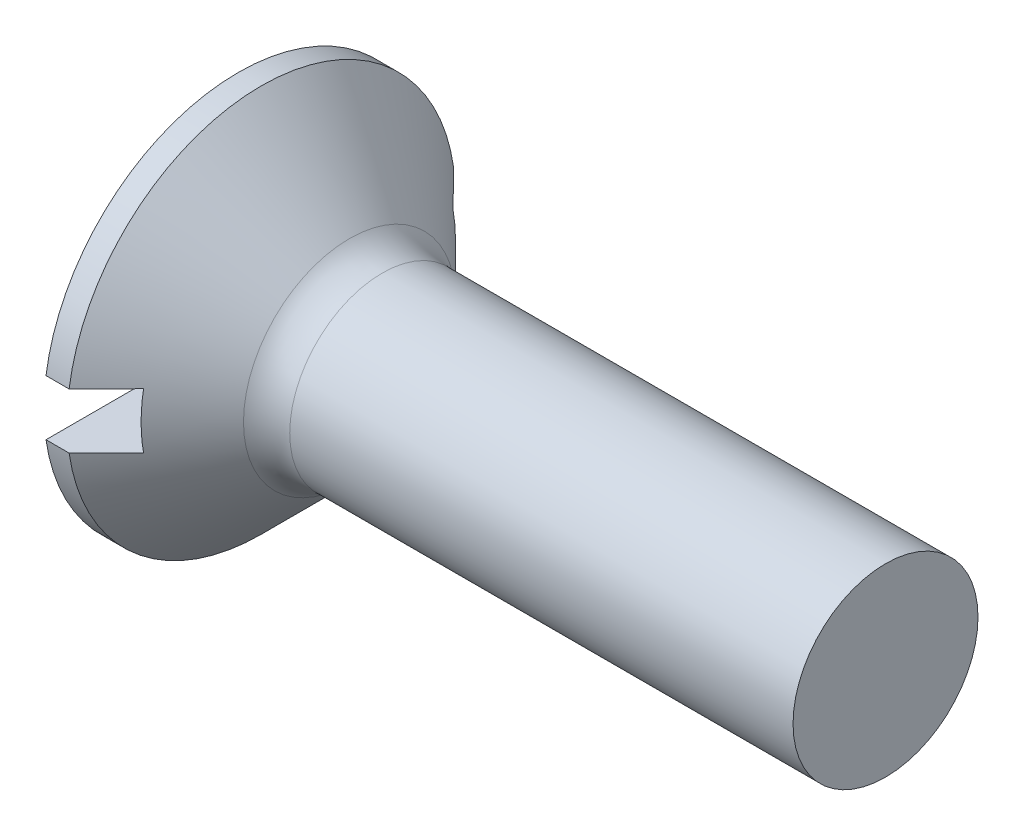
ISO-10303-21;
HEADER;
FILE_DESCRIPTION(('STEP AP214'),'2;1');
FILE_NAME('part.step','',(''),(''),'','','');
FILE_SCHEMA(('AUTOMOTIVE_DESIGN { 1 0 10303 214 1 1 1 1 }'));
ENDSEC;
DATA;
#1=APPLICATION_CONTEXT('core data for automotive mechanical design processes');
#2=APPLICATION_PROTOCOL_DEFINITION('international standard','automotive_design',2000,#1);
#3=PRODUCT_CONTEXT('',#1,'mechanical');
#4=PRODUCT('Part','Part','',(#3));
#5=PRODUCT_RELATED_PRODUCT_CATEGORY('part','',(#4));
#6=PRODUCT_DEFINITION_FORMATION('','',#4);
#7=PRODUCT_DEFINITION_CONTEXT('part definition',#1,'design');
#8=PRODUCT_DEFINITION('design','',#6,#7);
#9=PRODUCT_DEFINITION_SHAPE('','',#8);
#10=(LENGTH_UNIT() NAMED_UNIT(*) SI_UNIT(.MILLI.,.METRE.));
#11=(NAMED_UNIT(*) PLANE_ANGLE_UNIT() SI_UNIT($,.RADIAN.));
#12=(NAMED_UNIT(*) SI_UNIT($,.STERADIAN.) SOLID_ANGLE_UNIT());
#13=UNCERTAINTY_MEASURE_WITH_UNIT(LENGTH_MEASURE(1.E-05),#10,'distance_accuracy_value','');
#14=(GEOMETRIC_REPRESENTATION_CONTEXT(3) GLOBAL_UNCERTAINTY_ASSIGNED_CONTEXT((#13)) GLOBAL_UNIT_ASSIGNED_CONTEXT((#10,
#11,#12)) REPRESENTATION_CONTEXT('',''));
#15=CARTESIAN_POINT('',(0.,0.,0.));
#16=DIRECTION('',(0.,0.,1.));
#17=DIRECTION('',(1.,0.,0.));
#18=AXIS2_PLACEMENT_3D('',#15,#16,#17);
#19=CARTESIAN_POINT('',(0.,0.,0.));
#20=DIRECTION('',(-1.,0.,0.));
#21=DIRECTION('',(0.,0.,1.));
#22=AXIS2_PLACEMENT_3D('',#19,#20,#21);
#23=PLANE('',#22);
#24=DIRECTION('',(0.,0.,-1.));
#25=VECTOR('',#24,1.);
#26=CARTESIAN_POINT('',(0.,0.6,4.2));
#27=LINE('',#26,#25);
#28=CARTESIAN_POINT('',(0.,0.6,4.15692193816531));
#29=VERTEX_POINT('',#28);
#30=CARTESIAN_POINT('',(0.,0.599999999999999,-4.15692193816531));
#31=VERTEX_POINT('',#30);
#32=EDGE_CURVE('E169',#29,#31,#27,.T.);
#33=ORIENTED_EDGE('',*,*,#32,.F.);
#34=CARTESIAN_POINT('',(0.,0.,0.));
#35=DIRECTION('',(-1.,0.,0.));
#36=DIRECTION('',(0.,0.,1.));
#37=AXIS2_PLACEMENT_3D('',#34,#35,#36);
#38=CIRCLE('',#37,4.2);
#39=EDGE_CURVE('E113',#29,#31,#38,.T.);
#40=ORIENTED_EDGE('',*,*,#39,.T.);
#41=EDGE_LOOP('',(#33,#40));
#42=FACE_BOUND('',#41,.T.);
#43=ADVANCED_FACE('F32',(#42),#23,.T.);
#44=CARTESIAN_POINT('',(-6.34999999999999,0.,0.));
#45=DIRECTION('',(-1.,0.,0.));
#46=DIRECTION('',(0.,0.,1.));
#47=AXIS2_PLACEMENT_3D('',#44,#45,#46);
#48=CYLINDRICAL_SURFACE('',#47,4.2);
#49=DIRECTION('',(-1.,0.,0.));
#50=VECTOR('',#49,1.);
#51=CARTESIAN_POINT('',(-6.34999999999999,0.599999999999999,-4.15692193816531));
#52=LINE('',#51,#50);
#53=CARTESIAN_POINT('',(0.500000000000008,0.599999999999999,-4.15692193816531));
#54=VERTEX_POINT('',#53);
#55=EDGE_CURVE('E60',#31,#54,#52,.F.);
#56=ORIENTED_EDGE('',*,*,#55,.F.);
#57=ORIENTED_EDGE('',*,*,#39,.F.);
#58=DIRECTION('',(-1.,0.,0.));
#59=VECTOR('',#58,1.);
#60=CARTESIAN_POINT('',(-6.34999999999999,0.6,4.15692193816531));
#61=LINE('',#60,#59);
#62=CARTESIAN_POINT('',(0.500000000000007,0.6,4.15692193816531));
#63=VERTEX_POINT('',#62);
#64=EDGE_CURVE('E175',#63,#29,#61,.T.);
#65=ORIENTED_EDGE('',*,*,#64,.F.);
#66=CARTESIAN_POINT('',(0.500000000000008,0.,0.));
#67=DIRECTION('',(-1.,0.,0.));
#68=DIRECTION('',(0.,0.,1.));
#69=AXIS2_PLACEMENT_3D('',#66,#67,#68);
#70=CIRCLE('',#69,4.2);
#71=EDGE_CURVE('E107',#63,#54,#70,.T.);
#72=ORIENTED_EDGE('',*,*,#71,.T.);
#73=EDGE_LOOP('',(#56,#57,#65,#72));
#74=FACE_BOUND('',#73,.T.);
#75=ADVANCED_FACE('F153',(#74),#48,.T.);
#76=DIRECTION('',(0.,0.,1.));
#77=VECTOR('',#76,1.);
#78=CARTESIAN_POINT('',(0.,-0.600000000000001,-4.2));
#79=LINE('',#78,#77);
#80=CARTESIAN_POINT('',(0.,-0.600000000000001,-4.15692193816531));
#81=VERTEX_POINT('',#80);
#82=CARTESIAN_POINT('',(0.,-0.600000000000001,4.15692193816531));
#83=VERTEX_POINT('',#82);
#84=EDGE_CURVE('E101',#81,#83,#79,.T.);
#85=ORIENTED_EDGE('',*,*,#84,.F.);
#86=EDGE_CURVE('E109',#81,#83,#38,.T.);
#87=ORIENTED_EDGE('',*,*,#86,.T.);
#88=EDGE_LOOP('',(#85,#87));
#89=FACE_BOUND('',#88,.T.);
#90=ADVANCED_FACE('F155',(#89),#23,.T.);
#91=DIRECTION('',(-1.,0.,0.));
#92=VECTOR('',#91,1.);
#93=CARTESIAN_POINT('',(-6.34999999999999,-0.600000000000001,4.15692193816531));
#94=LINE('',#93,#92);
#95=CARTESIAN_POINT('',(0.500000000000008,-0.600000000000001,4.15692193816531));
#96=VERTEX_POINT('',#95);
#97=EDGE_CURVE('E174',#83,#96,#94,.F.);
#98=ORIENTED_EDGE('',*,*,#97,.F.);
#99=ORIENTED_EDGE('',*,*,#86,.F.);
#100=DIRECTION('',(-1.,0.,0.));
#101=VECTOR('',#100,1.);
#102=CARTESIAN_POINT('',(-6.34999999999999,-0.600000000000001,-4.15692193816531));
#103=LINE('',#102,#101);
#104=CARTESIAN_POINT('',(0.500000000000007,-0.600000000000001,-4.15692193816531));
#105=VERTEX_POINT('',#104);
#106=EDGE_CURVE('E172',#105,#81,#103,.T.);
#107=ORIENTED_EDGE('',*,*,#106,.F.);
#108=EDGE_CURVE('E110',#105,#96,#70,.T.);
#109=ORIENTED_EDGE('',*,*,#108,.T.);
#110=EDGE_LOOP('',(#98,#99,#107,#109));
#111=FACE_BOUND('',#110,.T.);
#112=ADVANCED_FACE('F150',(#111),#48,.T.);
#113=CARTESIAN_POINT('',(0.500000000000008,0.,0.));
#114=DIRECTION('',(-1.,0.,0.));
#115=DIRECTION('',(0.,0.,1.));
#116=AXIS2_PLACEMENT_3D('',#113,#114,#115);
#117=CONICAL_SURFACE('',#116,4.2,0.78539816339745);
#118=CARTESIAN_POINT('',(-4.56300554633495,0.599999999999999,-9.24355298310301));
#119=CARTESIAN_POINT('',(-4.24600723603534,0.599999999999999,-8.9258823515088));
#120=CARTESIAN_POINT('',(-3.92903833767224,0.599999999999999,-8.60818235148398));
#121=CARTESIAN_POINT('',(-3.29519089252672,0.599999999999999,-7.97268003561219));
#122=CARTESIAN_POINT('',(-2.97831234760131,0.599999999999999,-7.65487771791312));
#123=CARTESIAN_POINT('',(-2.34455187800565,0.599999999999999,-7.01900148987753));
#124=CARTESIAN_POINT('',(-2.02767001153056,0.599999999999999,-6.70092752152941));
#125=CARTESIAN_POINT('',(-1.39411705313906,0.599999999999999,-6.06458161569545));
#126=CARTESIAN_POINT('',(-1.07744595737823,0.599999999999999,-5.74630968203736));
#127=CARTESIAN_POINT('',(-0.439782710122314,0.599999999999999,-5.1047678174329));
#128=CARTESIAN_POINT('',(-0.118795367868508,0.599999999999999,-4.78149310334207));
#129=CARTESIAN_POINT('',(0.362237947121695,0.599999999999999,-4.2961185225288));
#130=CARTESIAN_POINT('',(0.522512438448331,0.599999999999999,-4.13424518132528));
#131=CARTESIAN_POINT('',(0.842841859731234,0.599999999999999,-3.81028322215853));
#132=CARTESIAN_POINT('',(1.00289679095939,0.6,-3.64819460545317));
#133=CARTESIAN_POINT('',(1.32264436811793,0.6,-3.32374686654893));
#134=CARTESIAN_POINT('',(1.48233710058699,0.6,-3.16138782970926));
#135=CARTESIAN_POINT('',(1.80122734793049,0.6,-2.83617699742847));
#136=CARTESIAN_POINT('',(1.96042485168805,0.6,-2.67332519108527));
#137=CARTESIAN_POINT('',(2.27798310090217,0.6,-2.346837401424));
#138=CARTESIAN_POINT('',(2.43634393039256,0.6,-2.1832015001327));
#139=CARTESIAN_POINT('',(2.67269924336134,0.6,-1.93661567733266));
#140=CARTESIAN_POINT('',(2.75128528365289,0.6,-1.8542332395846));
#141=CARTESIAN_POINT('',(2.90787263193201,0.6,-1.68891500745495));
#142=CARTESIAN_POINT('',(2.9858739476244,0.6,-1.60597922039208));
#143=CARTESIAN_POINT('',(3.10544684138226,0.6,-1.47745401397705));
#144=CARTESIAN_POINT('',(3.14733724784235,0.6,-1.43216144834644));
#145=CARTESIAN_POINT('',(3.23076972006657,0.6,-1.34125476648715));
#146=CARTESIAN_POINT('',(3.27231177917342,0.6,-1.29564064414372));
#147=CARTESIAN_POINT('',(3.35490511324606,0.6,-1.20402456521516));
#148=CARTESIAN_POINT('',(3.39595670135904,0.6,-1.15802289202377));
#149=CARTESIAN_POINT('',(3.47741398126422,0.6,-1.06545539858625));
#150=CARTESIAN_POINT('',(3.51781969732899,0.6,-1.01888959965672));
#151=CARTESIAN_POINT('',(3.61534617885595,0.6,-0.904304101505886));
#152=CARTESIAN_POINT('',(3.67198890051813,0.6,-0.835870311358796));
#153=CARTESIAN_POINT('',(3.75443491954113,0.6,-0.731128116472688));
#154=CARTESIAN_POINT('',(3.78151872315025,0.6,-0.695835241457916));
#155=CARTESIAN_POINT('',(3.83442818781308,0.6,-0.624333469704639));
#156=CARTESIAN_POINT('',(3.86025411081286,0.6,-0.58812476608869));
#157=CARTESIAN_POINT('',(3.91931375630114,0.6,-0.500871666719931));
#158=CARTESIAN_POINT('',(3.95177061612795,0.6,-0.449276850099302));
#159=CARTESIAN_POINT('',(3.99577967360525,0.6,-0.369336690861509));
#160=CARTESIAN_POINT('',(4.00966067743335,0.6,-0.342288140870185));
#161=CARTESIAN_POINT('',(4.03525638339725,0.6,-0.287195591030007));
#162=CARTESIAN_POINT('',(4.04697271406413,0.6,-0.259152358592044));
#163=CARTESIAN_POINT('',(4.06984222692527,0.6,-0.195380760375152));
#164=CARTESIAN_POINT('',(4.08024433174417,0.6,-0.159369843717824));
#165=CARTESIAN_POINT('',(4.09489065039257,0.6,-0.0861793611594762));
#166=CARTESIAN_POINT('',(4.09915715820778,0.6,-0.0490045302917276));
#167=CARTESIAN_POINT('',(4.10061628758592,0.6,0.0256851394983997));
#168=CARTESIAN_POINT('',(4.09777267133953,0.6,0.0632007452673676));
#169=CARTESIAN_POINT('',(4.08560858363434,0.6,0.137201967278454));
#170=CARTESIAN_POINT('',(4.07626994022889,0.6,0.173684394091389));
#171=CARTESIAN_POINT('',(4.05240105619193,0.6,0.246171642438104));
#172=CARTESIAN_POINT('',(4.03770931771714,0.6,0.282120755866795));
#173=CARTESIAN_POINT('',(4.0048507034635,0.6,0.352421052836944));
#174=CARTESIAN_POINT('',(3.98667753444948,0.6,0.386769200401987));
#175=CARTESIAN_POINT('',(3.94786976325244,0.6,0.454391698020889));
#176=CARTESIAN_POINT('',(3.92721638813711,0.6,0.487655075912775));
#177=CARTESIAN_POINT('',(3.88433578239058,0.6,0.553097784406296));
#178=CARTESIAN_POINT('',(3.86210991115064,0.6,0.585278016688102));
#179=CARTESIAN_POINT('',(3.81457382028797,0.6,0.651581987389193));
#180=CARTESIAN_POINT('',(3.7891630851111,0.6,0.685633148831194));
#181=CARTESIAN_POINT('',(3.73740972159131,0.6,0.753022281860292));
#182=CARTESIAN_POINT('',(3.71106696643727,0.6,0.786360155399126));
#183=CARTESIAN_POINT('',(3.63101189507472,0.6,0.885596261553081));
#184=CARTESIAN_POINT('',(3.57629754538183,0.6,0.950683598839951));
#185=CARTESIAN_POINT('',(3.46525380311496,0.6,1.07965626888597));
#186=CARTESIAN_POINT('',(3.40892163508868,0.6,1.14353918079179));
#187=CARTESIAN_POINT('',(3.29530585051175,0.6,1.27041803727517));
#188=CARTESIAN_POINT('',(3.23802251714466,0.6,1.33341423588146));
#189=CARTESIAN_POINT('',(3.12298479001919,0.6,1.45862383839196));
#190=CARTESIAN_POINT('',(3.06523233266877,0.6,1.52083902752064));
#191=CARTESIAN_POINT('',(2.94927074499088,0.6,1.64485037779584));
#192=CARTESIAN_POINT('',(2.89106158145176,0.6,1.70664650784765));
#193=CARTESIAN_POINT('',(2.71607782742413,0.6,1.8914362035954));
#194=CARTESIAN_POINT('',(2.598818175117,0.6,2.01396998991091));
#195=CARTESIAN_POINT('',(2.36411448960321,0.6,2.25774708248496));
#196=CARTESIAN_POINT('',(2.2466739355813,0.6,2.37899374959426));
#197=CARTESIAN_POINT('',(2.011320643903,0.6,2.62102822482681));
#198=CARTESIAN_POINT('',(1.89340790524034,0.6,2.74181603197111));
#199=CARTESIAN_POINT('',(1.53920067574072,0.6,3.10372997116225));
#200=CARTESIAN_POINT('',(1.30244210211621,0.6,3.34440153097691));
#201=CARTESIAN_POINT('',(0.828195724568521,0.6,3.82523070246839));
#202=CARTESIAN_POINT('',(0.590707648083579,0.6,4.06538804483313));
#203=CARTESIAN_POINT('',(0.115359689803594,0.6,4.54532999337504));
#204=CARTESIAN_POINT('',(-0.122500188487137,0.6,4.78511460302333));
#205=CARTESIAN_POINT('',(-0.598435859528591,0.6,5.26442998810649));
#206=CARTESIAN_POINT('',(-0.836511632808682,0.6,5.50396078288318));
#207=CARTESIAN_POINT('',(-1.31282357210655,0.6,5.9828640036053));
#208=CARTESIAN_POINT('',(-1.55105973851771,0.600000000000001,6.22223642915941));
#209=CARTESIAN_POINT('',(-2.26588146323333,0.600000000000001,6.94013600092059));
#210=CARTESIAN_POINT('',(-2.74263267398125,0.600000000000001,7.41849819223158));
#211=CARTESIAN_POINT('',(-3.33143893672129,0.600000000000001,8.0089998304997));
#212=CARTESIAN_POINT('',(-3.44338145682948,0.600000000000001,8.12125154439743));
#213=CARTESIAN_POINT('',(-3.66728071302648,0.600000000000001,8.34574469921585));
#214=CARTESIAN_POINT('',(-3.77923744932913,0.600000000000001,8.45798613992331));
#215=CARTESIAN_POINT('',(-4.0031582180191,0.600000000000001,8.68245495354625));
#216=CARTESIAN_POINT('',(-4.11512225008232,0.600000000000001,8.79468232678506));
#217=CARTESIAN_POINT('',(-4.33905795383685,0.600000000000001,9.019125541103));
#218=CARTESIAN_POINT('',(-4.45102962536065,0.600000000000001,9.13134138234926));
#219=CARTESIAN_POINT('',(-4.56300554633495,0.600000000000001,9.24355298310301));
#220=B_SPLINE_CURVE_WITH_KNOTS('',3,(#118,#119,#120,#121,#122,#123,#124,#125,#126,#127,#128,
#129,#130,#131,#132,#133,#134,#135,#136,#137,#138,#139,#140,#141,#142,#143,#144,#145,#146,#147,
#148,#149,#150,#151,#152,#153,#154,#155,#156,#157,#158,#159,#160,#161,#162,#163,#164,#165,#166,
#167,#168,#169,#170,#171,#172,#173,#174,#175,#176,#177,#178,#179,#180,#181,#182,#183,#184,#185,
#186,#187,#188,#189,#190,#191,#192,#193,#194,#195,#196,#197,#198,#199,#200,#201,#202,#203,#204,
#205,#206,#207,#208,#209,#210,#211,#212,#213,#214,#215,#216,#217,#218,#219),.UNSPECIFIED.,.F.,
.F.,(4,2,2,2,2,2,2,2,2,2,2,2,2,2,2,2,2,2,2,2,2,2,2,2,2,2,2,2,2,2,2,2,2,2,2,2,2,2,2,2,2,2,2,2,2,
2,2,2,2,2,4),(0.,1.34633691031337,2.6926997414925,4.03964677515628,5.38656852786769,
6.75326280996175,7.43664982710673,8.12003286861158,8.80323043061789,9.48644321990409,
10.1695860319826,10.5111450988142,10.8526996570424,11.03778202096,11.2228679139641,
11.4078285352327,11.5927821890647,11.8592146640371,11.9926530436262,12.1260635156147,
12.3086320349772,12.399769493737,12.490838106084,12.6028793993505,12.7145125475576,
12.8267158093192,12.939234265636,13.0554743148281,13.1719265035455,13.2893234418316,
13.4066201044699,13.5340600053015,13.6615173128626,13.91655652205,14.1720630220887,
14.4274947695286,14.6821578166047,14.9368395576516,15.4456347637855,15.9520298164414,
16.4584259488448,17.4712394731476,18.484493856319,19.4977387462517,20.5108998896107,
21.5240635270661,23.5501676869924,24.0257559307744,24.5013524664906,24.9769345830622,
25.4525083962336),.UNSPECIFIED.);
#221=CARTESIAN_POINT('',(1.3,0.6,3.34664010613631));
#222=VERTEX_POINT('',#221);
#223=EDGE_CURVE('E11',#222,#63,#220,.T.);
#224=ORIENTED_EDGE('',*,*,#223,.F.);
#225=CARTESIAN_POINT('',(1.3,0.,0.));
#226=DIRECTION('',(1.,0.,0.));
#227=DIRECTION('',(0.,0.,-1.));
#228=AXIS2_PLACEMENT_3D('',#225,#226,#227);
#229=CIRCLE('',#228,3.40000000000001);
#230=CARTESIAN_POINT('',(1.3,-0.600000000000001,3.34664010613631));
#231=VERTEX_POINT('',#230);
#232=EDGE_CURVE('E89',#231,#222,#229,.F.);
#233=ORIENTED_EDGE('',*,*,#232,.F.);
#234=CARTESIAN_POINT('',(-4.56300554633495,-0.600000000000001,9.24355298310301));
#235=CARTESIAN_POINT('',(-4.24600723603534,-0.600000000000001,8.9258823515088));
#236=CARTESIAN_POINT('',(-3.92903833767224,-0.600000000000001,8.60818235148397));
#237=CARTESIAN_POINT('',(-3.29519089252671,-0.600000000000001,7.97268003561219));
#238=CARTESIAN_POINT('',(-2.9783123476013,-0.600000000000001,7.65487771791311));
#239=CARTESIAN_POINT('',(-2.34455187800563,-0.600000000000001,7.01900148987752));
#240=CARTESIAN_POINT('',(-2.02767001153054,-0.600000000000001,6.7009275215294));
#241=CARTESIAN_POINT('',(-1.39411705313904,-0.600000000000001,6.06458161569543));
#242=CARTESIAN_POINT('',(-1.07744595737821,-0.600000000000001,5.74630968203734));
#243=CARTESIAN_POINT('',(-0.439782710122293,-0.600000000000001,5.10476781743288));
#244=CARTESIAN_POINT('',(-0.118795367868489,-0.600000000000001,4.78149310334206));
#245=CARTESIAN_POINT('',(0.362237947121712,-0.600000000000001,4.29611852252878));
#246=CARTESIAN_POINT('',(0.522512438448347,-0.600000000000001,4.13424518132526));
#247=CARTESIAN_POINT('',(0.842841859731247,-0.600000000000001,3.81028322215852));
#248=CARTESIAN_POINT('',(1.0028967909594,-0.600000000000001,3.64819460545316));
#249=CARTESIAN_POINT('',(1.32264436811794,-0.600000000000001,3.32374686654892));
#250=CARTESIAN_POINT('',(1.482337100587,-0.600000000000001,3.16138782970925));
#251=CARTESIAN_POINT('',(1.8012273479305,-0.600000000000001,2.83617699742846));
#252=CARTESIAN_POINT('',(1.96042485168806,-0.600000000000001,2.67332519108526));
#253=CARTESIAN_POINT('',(2.27798310090218,-0.600000000000001,2.346837401424));
#254=CARTESIAN_POINT('',(2.43634393039256,-0.600000000000001,2.18320150013269));
#255=CARTESIAN_POINT('',(2.67269924336134,-0.600000000000001,1.93661567733266));
#256=CARTESIAN_POINT('',(2.75128528365289,-0.600000000000001,1.85423323958459));
#257=CARTESIAN_POINT('',(2.90787263193201,-0.600000000000001,1.68891500745495));
#258=CARTESIAN_POINT('',(2.98587394762441,-0.600000000000001,1.60597922039208));
#259=CARTESIAN_POINT('',(3.10544684138226,-0.600000000000001,1.47745401397705));
#260=CARTESIAN_POINT('',(3.14733724784235,-0.600000000000001,1.43216144834644));
#261=CARTESIAN_POINT('',(3.23076972006657,-0.600000000000001,1.34125476648715));
#262=CARTESIAN_POINT('',(3.27231177917342,-0.600000000000001,1.29564064414372));
#263=CARTESIAN_POINT('',(3.35490511324606,-0.600000000000001,1.20402456521516));
#264=CARTESIAN_POINT('',(3.39595670135904,-0.600000000000001,1.15802289202377));
#265=CARTESIAN_POINT('',(3.47741398126422,-0.600000000000001,1.06545539858625));
#266=CARTESIAN_POINT('',(3.51781969732899,-0.600000000000001,1.01888959965672));
#267=CARTESIAN_POINT('',(3.61534617885595,-0.600000000000001,0.904304101505885));
#268=CARTESIAN_POINT('',(3.67198890051813,-0.600000000000001,0.835870311358794));
#269=CARTESIAN_POINT('',(3.75443491954113,-0.600000000000001,0.731128116472686));
#270=CARTESIAN_POINT('',(3.78151872315025,-0.600000000000001,0.695835241457914));
#271=CARTESIAN_POINT('',(3.83442818781308,-0.600000000000001,0.624333469704636));
#272=CARTESIAN_POINT('',(3.86025411081286,-0.600000000000001,0.588124766088687));
#273=CARTESIAN_POINT('',(3.91931375630114,-0.600000000000001,0.500871666719928));
#274=CARTESIAN_POINT('',(3.95177061612795,-0.600000000000001,0.449276850099299));
#275=CARTESIAN_POINT('',(3.99577967360525,-0.600000000000001,0.369336690861508));
#276=CARTESIAN_POINT('',(4.00966067743335,-0.600000000000001,0.342288140870185));
#277=CARTESIAN_POINT('',(4.03525638339725,-0.600000000000001,0.287195591030007));
#278=CARTESIAN_POINT('',(4.04697271406413,-0.600000000000001,0.259152358592045));
#279=CARTESIAN_POINT('',(4.06984222692527,-0.600000000000001,0.195380760375153));
#280=CARTESIAN_POINT('',(4.08024433174417,-0.600000000000001,0.159369843717825));
#281=CARTESIAN_POINT('',(4.09489065039257,-0.600000000000001,0.0861793611594771));
#282=CARTESIAN_POINT('',(4.09915715820778,-0.600000000000001,0.0490045302917284));
#283=CARTESIAN_POINT('',(4.10061628758592,-0.600000000000001,-0.0256851394983988));
#284=CARTESIAN_POINT('',(4.09777267133953,-0.600000000000001,-0.0632007452673665));
#285=CARTESIAN_POINT('',(4.08560858363434,-0.600000000000001,-0.137201967278453));
#286=CARTESIAN_POINT('',(4.07626994022889,-0.600000000000001,-0.173684394091389));
#287=CARTESIAN_POINT('',(4.05240105619192,-0.600000000000001,-0.246171642438104));
#288=CARTESIAN_POINT('',(4.03770931771714,-0.600000000000001,-0.282120755866795));
#289=CARTESIAN_POINT('',(4.0048507034635,-0.600000000000001,-0.352421052836943));
#290=CARTESIAN_POINT('',(3.98667753444948,-0.600000000000001,-0.386769200401986));
#291=CARTESIAN_POINT('',(3.94786976325244,-0.600000000000001,-0.454391698020888));
#292=CARTESIAN_POINT('',(3.92721638813711,-0.600000000000001,-0.487655075912773));
#293=CARTESIAN_POINT('',(3.88433578239059,-0.600000000000001,-0.553097784406295));
#294=CARTESIAN_POINT('',(3.86210991115064,-0.600000000000001,-0.585278016688101));
#295=CARTESIAN_POINT('',(3.81457382028797,-0.600000000000001,-0.651581987389193));
#296=CARTESIAN_POINT('',(3.7891630851111,-0.600000000000001,-0.685633148831194));
#297=CARTESIAN_POINT('',(3.73740972159131,-0.600000000000001,-0.753022281860292));
#298=CARTESIAN_POINT('',(3.71106696643727,-0.600000000000001,-0.786360155399125));
#299=CARTESIAN_POINT('',(3.63101189507472,-0.600000000000001,-0.88559626155308));
#300=CARTESIAN_POINT('',(3.57629754538184,-0.600000000000001,-0.950683598839949));
#301=CARTESIAN_POINT('',(3.46525380311496,-0.600000000000001,-1.07965626888597));
#302=CARTESIAN_POINT('',(3.40892163508868,-0.600000000000001,-1.14353918079178));
#303=CARTESIAN_POINT('',(3.29530585051175,-0.600000000000001,-1.27041803727517));
#304=CARTESIAN_POINT('',(3.23802251714466,-0.600000000000001,-1.33341423588145));
#305=CARTESIAN_POINT('',(3.12298479001919,-0.600000000000001,-1.45862383839196));
#306=CARTESIAN_POINT('',(3.06523233266877,-0.600000000000001,-1.52083902752064));
#307=CARTESIAN_POINT('',(2.94927074499088,-0.600000000000001,-1.64485037779583));
#308=CARTESIAN_POINT('',(2.89106158145176,-0.600000000000001,-1.70664650784765));
#309=CARTESIAN_POINT('',(2.71607782742413,-0.600000000000001,-1.8914362035954));
#310=CARTESIAN_POINT('',(2.598818175117,-0.600000000000001,-2.01396998991091));
#311=CARTESIAN_POINT('',(2.36411448960321,-0.600000000000001,-2.25774708248496));
#312=CARTESIAN_POINT('',(2.2466739355813,-0.600000000000001,-2.37899374959426));
#313=CARTESIAN_POINT('',(2.011320643903,-0.600000000000001,-2.62102822482681));
#314=CARTESIAN_POINT('',(1.89340790524035,-0.600000000000001,-2.74181603197111));
#315=CARTESIAN_POINT('',(1.53920067574072,-0.600000000000001,-3.10372997116224));
#316=CARTESIAN_POINT('',(1.30244210211622,-0.600000000000001,-3.34440153097691));
#317=CARTESIAN_POINT('',(0.828195724568526,-0.600000000000001,-3.82523070246838));
#318=CARTESIAN_POINT('',(0.590707648083584,-0.600000000000001,-4.06538804483312));
#319=CARTESIAN_POINT('',(0.1153596898036,-0.600000000000001,-4.54532999337504));
#320=CARTESIAN_POINT('',(-0.122500188487132,-0.600000000000001,-4.78511460302332));
#321=CARTESIAN_POINT('',(-0.598435859528585,-0.600000000000001,-5.26442998810648));
#322=CARTESIAN_POINT('',(-0.836511632808676,-0.600000000000001,-5.50396078288318));
#323=CARTESIAN_POINT('',(-1.31282357210654,-0.600000000000001,-5.98286400360529));
#324=CARTESIAN_POINT('',(-1.55105973851771,-0.600000000000001,-6.22223642915941));
#325=CARTESIAN_POINT('',(-2.26588146323332,-0.600000000000002,-6.94013600092058));
#326=CARTESIAN_POINT('',(-2.74263267398124,-0.600000000000001,-7.41849819223157));
#327=CARTESIAN_POINT('',(-3.33143893672128,-0.600000000000001,-8.00899983049969));
#328=CARTESIAN_POINT('',(-3.44338145682947,-0.600000000000001,-8.12125154439742));
#329=CARTESIAN_POINT('',(-3.66728071302648,-0.600000000000001,-8.34574469921585));
#330=CARTESIAN_POINT('',(-3.77923744932912,-0.600000000000001,-8.45798613992331));
#331=CARTESIAN_POINT('',(-4.0031582180191,-0.600000000000001,-8.68245495354624));
#332=CARTESIAN_POINT('',(-4.11512225008232,-0.600000000000001,-8.79468232678506));
#333=CARTESIAN_POINT('',(-4.33905795383685,-0.600000000000001,-9.019125541103));
#334=CARTESIAN_POINT('',(-4.45102962536065,-0.600000000000001,-9.13134138234926));
#335=CARTESIAN_POINT('',(-4.56300554633495,-0.600000000000001,-9.24355298310301));
#336=B_SPLINE_CURVE_WITH_KNOTS('',3,(#234,#235,#236,#237,#238,#239,#240,#241,#242,#243,#244,
#245,#246,#247,#248,#249,#250,#251,#252,#253,#254,#255,#256,#257,#258,#259,#260,#261,#262,#263,
#264,#265,#266,#267,#268,#269,#270,#271,#272,#273,#274,#275,#276,#277,#278,#279,#280,#281,#282,
#283,#284,#285,#286,#287,#288,#289,#290,#291,#292,#293,#294,#295,#296,#297,#298,#299,#300,#301,
#302,#303,#304,#305,#306,#307,#308,#309,#310,#311,#312,#313,#314,#315,#316,#317,#318,#319,#320,
#321,#322,#323,#324,#325,#326,#327,#328,#329,#330,#331,#332,#333,#334,#335),.UNSPECIFIED.,.F.,
.F.,(4,2,2,2,2,2,2,2,2,2,2,2,2,2,2,2,2,2,2,2,2,2,2,2,2,2,2,2,2,2,2,2,2,2,2,2,2,2,2,2,2,2,2,2,2,
2,2,2,2,2,4),(0.,1.34633691031338,2.69269974149251,4.0396467751563,5.38656852786772,
6.75326280996177,7.43664982710675,8.1200328686116,8.8032304306179,9.4864432199041,
10.1695860319826,10.5111450988142,10.8526996570424,11.03778202096,11.2228679139641,
11.4078285352327,11.5927821890647,11.8592146640371,11.9926530436262,12.1260635156147,
12.3086320349772,12.399769493737,12.490838106084,12.6028793993505,12.7145125475576,
12.8267158093192,12.939234265636,13.0554743148281,13.1719265035455,13.2893234418316,
13.4066201044699,13.5340600053015,13.6615173128626,13.91655652205,14.1720630220887,
14.4274947695286,14.6821578166047,14.9368395576516,15.4456347637855,15.9520298164414,
16.4584259488448,17.4712394731476,18.484493856319,19.4977387462517,20.5108998896107,
21.5240635270661,23.5501676869924,24.0257559307744,24.5013524664906,24.9769345830622,
25.4525083962336),.UNSPECIFIED.);
#337=EDGE_CURVE('E46',#96,#231,#336,.T.);
#338=ORIENTED_EDGE('',*,*,#337,.F.);
#339=ORIENTED_EDGE('',*,*,#108,.F.);
#340=CARTESIAN_POINT('',(1.3,-0.600000000000001,-3.34664010613631));
#341=VERTEX_POINT('',#340);
#342=EDGE_CURVE('E125',#341,#105,#336,.T.);
#343=ORIENTED_EDGE('',*,*,#342,.F.);
#344=CARTESIAN_POINT('',(1.3,0.6,-3.34664010613631));
#345=VERTEX_POINT('',#344);
#346=EDGE_CURVE('E97',#345,#341,#229,.F.);
#347=ORIENTED_EDGE('',*,*,#346,.F.);
#348=EDGE_CURVE('E36',#54,#345,#220,.T.);
#349=ORIENTED_EDGE('',*,*,#348,.F.);
#350=ORIENTED_EDGE('',*,*,#71,.F.);
#351=EDGE_LOOP('',(#224,#233,#338,#339,#343,#347,#349,#350));
#352=FACE_BOUND('',#351,.T.);
#353=CARTESIAN_POINT('',(2.40710678118655,0.,0.));
#354=DIRECTION('',(-1.,0.,0.));
#355=DIRECTION('',(0.,0.,1.));
#356=AXIS2_PLACEMENT_3D('',#353,#354,#355);
#357=CIRCLE('',#356,2.29289321881345);
#358=CARTESIAN_POINT('',(2.40710678118655,0.,2.29289321881345));
#359=VERTEX_POINT('',#358);
#360=EDGE_CURVE('E120',#359,#359,#357,.T.);
#361=ORIENTED_EDGE('',*,*,#360,.T.);
#362=EDGE_LOOP('',(#361));
#363=FACE_BOUND('',#362,.T.);
#364=ADVANCED_FACE('F104',(#352,#363),#117,.T.);
#365=CARTESIAN_POINT('',(-6.34999999999999,0.,0.));
#366=DIRECTION('',(-1.,0.,0.));
#367=DIRECTION('',(0.,0.,1.));
#368=AXIS2_PLACEMENT_3D('',#365,#366,#367);
#369=CYLINDRICAL_SURFACE('',#368,2.);
#370=CARTESIAN_POINT('',(3.1142135623731,0.,0.));
#371=DIRECTION('',(-1.,0.,0.));
#372=DIRECTION('',(0.,0.,1.));
#373=AXIS2_PLACEMENT_3D('',#370,#371,#372);
#374=CIRCLE('',#373,2.);
#375=CARTESIAN_POINT('',(3.1142135623731,0.,2.));
#376=VERTEX_POINT('',#375);
#377=EDGE_CURVE('E123',#376,#376,#374,.F.);
#378=ORIENTED_EDGE('',*,*,#377,.T.);
#379=EDGE_LOOP('',(#378));
#380=FACE_BOUND('',#379,.T.);
#381=CARTESIAN_POINT('',(14.,0.,0.));
#382=DIRECTION('',(-1.,0.,0.));
#383=DIRECTION('',(0.,0.,1.));
#384=AXIS2_PLACEMENT_3D('',#381,#382,#383);
#385=CIRCLE('',#384,2.);
#386=CARTESIAN_POINT('',(14.,0.,2.));
#387=VERTEX_POINT('',#386);
#388=EDGE_CURVE('E116',#387,#387,#385,.T.);
#389=ORIENTED_EDGE('',*,*,#388,.T.);
#390=EDGE_LOOP('',(#389));
#391=FACE_BOUND('',#390,.T.);
#392=ADVANCED_FACE('F143',(#380,#391),#369,.T.);
#393=CARTESIAN_POINT('',(14.,2.,0.));
#394=DIRECTION('',(1.,0.,0.));
#395=DIRECTION('',(0.,0.,-1.));
#396=AXIS2_PLACEMENT_3D('',#393,#394,#395);
#397=PLANE('',#396);
#398=ORIENTED_EDGE('',*,*,#388,.F.);
#399=EDGE_LOOP('',(#398));
#400=FACE_BOUND('',#399,.T.);
#401=ADVANCED_FACE('F141',(#400),#397,.T.);
#402=CARTESIAN_POINT('',(3.1142135623731,0.,0.));
#403=DIRECTION('',(-1.,0.,0.));
#404=DIRECTION('',(0.,0.,1.));
#405=AXIS2_PLACEMENT_3D('',#402,#403,#404);
#406=TOROIDAL_SURFACE('',#405,3.,1.);
#407=ORIENTED_EDGE('',*,*,#377,.F.);
#408=EDGE_LOOP('',(#407));
#409=FACE_BOUND('',#408,.T.);
#410=ORIENTED_EDGE('',*,*,#360,.F.);
#411=EDGE_LOOP('',(#410));
#412=FACE_BOUND('',#411,.T.);
#413=ADVANCED_FACE('F34',(#409,#412),#406,.F.);
#414=CARTESIAN_POINT('',(1.3,0.6,4.2));
#415=DIRECTION('',(0.,1.,0.));
#416=DIRECTION('',(0.,0.,1.));
#417=AXIS2_PLACEMENT_3D('',#414,#415,#416);
#418=PLANE('',#417);
#419=ORIENTED_EDGE('',*,*,#55,.T.);
#420=ORIENTED_EDGE('',*,*,#348,.T.);
#421=DIRECTION('',(0.,0.,-1.));
#422=VECTOR('',#421,1.);
#423=CARTESIAN_POINT('',(1.3,0.6,4.2));
#424=LINE('',#423,#422);
#425=EDGE_CURVE('E53',#222,#345,#424,.T.);
#426=ORIENTED_EDGE('',*,*,#425,.F.);
#427=ORIENTED_EDGE('',*,*,#223,.T.);
#428=ORIENTED_EDGE('',*,*,#64,.T.);
#429=ORIENTED_EDGE('',*,*,#32,.T.);
#430=EDGE_LOOP('',(#419,#420,#426,#427,#428,#429));
#431=FACE_BOUND('',#430,.T.);
#432=ADVANCED_FACE('F98',(#431),#418,.F.);
#433=CARTESIAN_POINT('',(1.3,-0.600000000000001,-4.2));
#434=DIRECTION('',(0.,-1.,0.));
#435=DIRECTION('',(0.,0.,-1.));
#436=AXIS2_PLACEMENT_3D('',#433,#434,#435);
#437=PLANE('',#436);
#438=ORIENTED_EDGE('',*,*,#97,.T.);
#439=ORIENTED_EDGE('',*,*,#337,.T.);
#440=DIRECTION('',(0.,0.,1.));
#441=VECTOR('',#440,1.);
#442=CARTESIAN_POINT('',(1.3,-0.600000000000001,-4.2));
#443=LINE('',#442,#441);
#444=EDGE_CURVE('E92',#341,#231,#443,.T.);
#445=ORIENTED_EDGE('',*,*,#444,.F.);
#446=ORIENTED_EDGE('',*,*,#342,.T.);
#447=ORIENTED_EDGE('',*,*,#106,.T.);
#448=ORIENTED_EDGE('',*,*,#84,.T.);
#449=EDGE_LOOP('',(#438,#439,#445,#446,#447,#448));
#450=FACE_BOUND('',#449,.T.);
#451=ADVANCED_FACE('F133',(#450),#437,.F.);
#452=CARTESIAN_POINT('',(1.3,-0.600000000000001,-4.2));
#453=DIRECTION('',(1.,0.,0.));
#454=DIRECTION('',(0.,0.,-1.));
#455=AXIS2_PLACEMENT_3D('',#452,#453,#454);
#456=PLANE('',#455);
#457=ORIENTED_EDGE('',*,*,#232,.T.);
#458=ORIENTED_EDGE('',*,*,#425,.T.);
#459=ORIENTED_EDGE('',*,*,#346,.T.);
#460=ORIENTED_EDGE('',*,*,#444,.T.);
#461=EDGE_LOOP('',(#457,#458,#459,#460));
#462=FACE_BOUND('',#461,.T.);
#463=ADVANCED_FACE('F90',(#462),#456,.F.);
#464=CLOSED_SHELL('',(#43,#75,#90,#112,#364,#392,#401,#413,#432,#451,#463));
#465=MANIFOLD_SOLID_BREP('B2',#464);
#466=ADVANCED_BREP_SHAPE_REPRESENTATION('',(#18,#465),#14);
#467=SHAPE_DEFINITION_REPRESENTATION(#9,#466);
ENDSEC;
END-ISO-10303-21;
